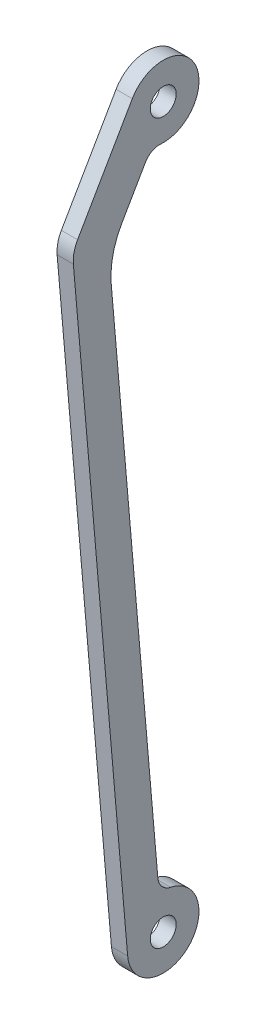
ISO-10303-21;
HEADER;
FILE_DESCRIPTION(('STEP AP214'),'2;1');
FILE_NAME('part.step','',(''),(''),'','','');
FILE_SCHEMA(('AUTOMOTIVE_DESIGN { 1 0 10303 214 1 1 1 1 }'));
ENDSEC;
DATA;
#1=APPLICATION_CONTEXT('core data for automotive mechanical design processes');
#2=APPLICATION_PROTOCOL_DEFINITION('international standard','automotive_design',2000,#1);
#3=PRODUCT_CONTEXT('',#1,'mechanical');
#4=PRODUCT('Part','Part','',(#3));
#5=PRODUCT_RELATED_PRODUCT_CATEGORY('part','',(#4));
#6=PRODUCT_DEFINITION_FORMATION('','',#4);
#7=PRODUCT_DEFINITION_CONTEXT('part definition',#1,'design');
#8=PRODUCT_DEFINITION('design','',#6,#7);
#9=PRODUCT_DEFINITION_SHAPE('','',#8);
#10=(LENGTH_UNIT() NAMED_UNIT(*) SI_UNIT(.MILLI.,.METRE.));
#11=(NAMED_UNIT(*) PLANE_ANGLE_UNIT() SI_UNIT($,.RADIAN.));
#12=(NAMED_UNIT(*) SI_UNIT($,.STERADIAN.) SOLID_ANGLE_UNIT());
#13=UNCERTAINTY_MEASURE_WITH_UNIT(LENGTH_MEASURE(1.E-05),#10,'distance_accuracy_value','');
#14=(GEOMETRIC_REPRESENTATION_CONTEXT(3) GLOBAL_UNCERTAINTY_ASSIGNED_CONTEXT((#13)) GLOBAL_UNIT_ASSIGNED_CONTEXT((#10,
#11,#12)) REPRESENTATION_CONTEXT('',''));
#15=CARTESIAN_POINT('',(0.,0.,0.));
#16=DIRECTION('',(0.,0.,1.));
#17=DIRECTION('',(1.,0.,0.));
#18=AXIS2_PLACEMENT_3D('',#15,#16,#17);
#19=CARTESIAN_POINT('',(113.199999999921,97.2400642056118,1.13156945828929));
#20=DIRECTION('',(1.,8.34917204817209E-13,0.));
#21=DIRECTION('',(0.,0.,1.));
#22=AXIS2_PLACEMENT_3D('',#19,#20,#21);
#23=PLANE('',#22);
#24=CARTESIAN_POINT('',(113.199999999908,113.200000000002,0.));
#25=DIRECTION('',(1.,8.34917204817209E-13,0.));
#26=DIRECTION('',(0.,0.,1.));
#27=AXIS2_PLACEMENT_3D('',#24,#25,#26);
#28=CIRCLE('',#27,4.);
#29=CARTESIAN_POINT('',(113.199999999908,113.200000000002,4.));
#30=VERTEX_POINT('',#29);
#31=EDGE_CURVE('E161',#30,#30,#28,.T.);
#32=ORIENTED_EDGE('',*,*,#31,.F.);
#33=EDGE_LOOP('',(#32));
#34=FACE_BOUND('',#33,.T.);
#35=CARTESIAN_POINT('',(113.199999999921,97.2400642056118,1.13156945828929));
#36=DIRECTION('',(-1.,-8.34917204817209E-13,0.));
#37=DIRECTION('',(0.,0.,1.));
#38=AXIS2_PLACEMENT_3D('',#35,#36,#37);
#39=CIRCLE('',#38,4.99999999999925);
#40=CARTESIAN_POINT('',(113.199999999919,99.74006420556,5.46169647723965));
#41=VERTEX_POINT('',#40);
#42=CARTESIAN_POINT('',(113.199999999917,102.227544141359,0.777954002572745));
#43=VERTEX_POINT('',#42);
#44=EDGE_CURVE('E185',#41,#43,#39,.T.);
#45=ORIENTED_EDGE('',*,*,#44,.T.);
#46=CARTESIAN_POINT('',(113.199999999908,113.200000000002,0.));
#47=DIRECTION('',(1.,8.34917204817209E-13,0.));
#48=DIRECTION('',(0.,0.,1.));
#49=AXIS2_PLACEMENT_3D('',#46,#47,#48);
#50=CIRCLE('',#49,11.);
#51=CARTESIAN_POINT('',(113.199999999903,118.699999999889,9.52627944169444));
#52=VERTEX_POINT('',#51);
#53=EDGE_CURVE('E109',#43,#52,#50,.T.);
#54=ORIENTED_EDGE('',*,*,#53,.T.);
#55=DIRECTION('',(7.23059509433379E-13,-0.866025403790403,0.499999999989669));
#56=VECTOR('',#55,1.);
#57=CARTESIAN_POINT('',(113.199999999903,118.699999999889,9.52627944169444));
#58=LINE('',#57,#56);
#59=CARTESIAN_POINT('',(113.199999999927,89.5267450916395,26.3694660156456));
#60=VERTEX_POINT('',#59);
#61=EDGE_CURVE('E214',#52,#60,#58,.T.);
#62=ORIENTED_EDGE('',*,*,#61,.T.);
#63=CARTESIAN_POINT('',(113.199999999932,84.5267450917569,17.709211977732));
#64=DIRECTION('',(1.,8.34917204817209E-13,0.));
#65=DIRECTION('',(0.,0.,1.));
#66=AXIS2_PLACEMENT_3D('',#63,#64,#65);
#67=CIRCLE('',#66,10.0000000000012);
#68=CARTESIAN_POINT('',(113.199999999932,83.6631878900357,27.6718556509435));
#69=VERTEX_POINT('',#68);
#70=EDGE_CURVE('E234',#60,#69,#67,.T.);
#71=ORIENTED_EDGE('',*,*,#70,.T.);
#72=DIRECTION('',(8.31798260822555E-13,-0.996264367320904,-0.0863557201734733));
#73=VECTOR('',#72,1.);
#74=CARTESIAN_POINT('',(113.199999999932,83.6631878900357,27.6718556509435));
#75=LINE('',#74,#73);
#76=CARTESIAN_POINT('',(113.200000000093,-109.149912921906,10.9589080381815));
#77=VERTEX_POINT('',#76);
#78=EDGE_CURVE('E230',#69,#77,#75,.T.);
#79=ORIENTED_EDGE('',*,*,#78,.T.);
#80=CARTESIAN_POINT('',(113.200000000093,-108.199999999998,-2.34845256395263E-09));
#81=DIRECTION('',(1.,8.34917204817209E-13,0.));
#82=DIRECTION('',(0.,0.,1.));
#83=AXIS2_PLACEMENT_3D('',#80,#81,#82);
#84=CIRCLE('',#83,11.);
#85=CARTESIAN_POINT('',(113.200000000084,-97.4387806499971,-2.27950830484906));
#86=VERTEX_POINT('',#85);
#87=EDGE_CURVE('E233',#77,#86,#84,.T.);
#88=ORIENTED_EDGE('',*,*,#87,.T.);
#89=CARTESIAN_POINT('',(113.200000000079,-92.5473173090877,-3.31564844234932));
#90=DIRECTION('',(-1.,-8.34917204817209E-13,0.));
#91=DIRECTION('',(0.,0.,1.));
#92=AXIS2_PLACEMENT_3D('',#89,#90,#91);
#93=CIRCLE('',#92,5.);
#94=CARTESIAN_POINT('',(113.20000000008,-92.979095909955,1.6656733942552));
#95=VERTEX_POINT('',#94);
#96=EDGE_CURVE('E134',#86,#95,#93,.T.);
#97=ORIENTED_EDGE('',*,*,#96,.T.);
#98=DIRECTION('',(-8.31798260822554E-13,0.996264367320904,0.0863557201734732));
#99=VECTOR('',#98,1.);
#100=CARTESIAN_POINT('',(113.199999999942,72.4579697256369,16.0056793354151));
#101=LINE('',#100,#99);
#102=CARTESIAN_POINT('',(113.199999999942,72.4579697256369,16.0056793354151));
#103=VERTEX_POINT('',#102);
#104=EDGE_CURVE('E128',#95,#103,#101,.T.);
#105=ORIENTED_EDGE('',*,*,#104,.T.);
#106=CARTESIAN_POINT('',(113.19999999994,74.6168627299737,-8.90092984760749));
#107=DIRECTION('',(-1.,-8.34917204817209E-13,0.));
#108=DIRECTION('',(0.,0.,1.));
#109=AXIS2_PLACEMENT_3D('',#106,#107,#108);
#110=CIRCLE('',#109,25.);
#111=CARTESIAN_POINT('',(113.199999999929,87.1168627297154,12.7497052471526));
#112=VERTEX_POINT('',#111);
#113=EDGE_CURVE('E132',#103,#112,#110,.T.);
#114=ORIENTED_EDGE('',*,*,#113,.T.);
#115=DIRECTION('',(-7.23059509433379E-13,0.866025403790404,-0.499999999989669));
#116=VECTOR('',#115,1.);
#117=CARTESIAN_POINT('',(113.199999999929,87.1168627297154,12.7497052471526));
#118=LINE('',#117,#116);
#119=EDGE_CURVE('E60',#112,#41,#118,.T.);
#120=ORIENTED_EDGE('',*,*,#119,.T.);
#121=EDGE_LOOP('',(#45,#54,#62,#71,#79,#88,#97,#105,#114,#120));
#122=FACE_BOUND('',#121,.T.);
#123=CARTESIAN_POINT('',(113.200000000093,-108.199999999998,-2.34845256395263E-09));
#124=DIRECTION('',(1.,8.34917204817209E-13,0.));
#125=DIRECTION('',(0.,0.,1.));
#126=AXIS2_PLACEMENT_3D('',#123,#124,#125);
#127=CIRCLE('',#126,3.99999999931337);
#128=CARTESIAN_POINT('',(113.200000000093,-108.199999999998,3.99999999696492));
#129=VERTEX_POINT('',#128);
#130=EDGE_CURVE('E252',#129,#129,#127,.T.);
#131=ORIENTED_EDGE('',*,*,#130,.F.);
#132=EDGE_LOOP('',(#131));
#133=FACE_BOUND('',#132,.T.);
#134=ADVANCED_FACE('F42',(#34,#122,#133),#23,.T.);
#135=CARTESIAN_POINT('',(108.199999999921,97.2400642056076,1.13156945828929));
#136=DIRECTION('',(1.,8.34917204817209E-13,0.));
#137=DIRECTION('',(0.,0.,1.));
#138=AXIS2_PLACEMENT_3D('',#135,#136,#137);
#139=PLANE('',#138);
#140=CARTESIAN_POINT('',(108.199999999921,97.2400642056076,1.13156945828929));
#141=DIRECTION('',(-1.,-8.34917204817209E-13,0.));
#142=DIRECTION('',(0.,0.,1.));
#143=AXIS2_PLACEMENT_3D('',#140,#141,#142);
#144=CIRCLE('',#143,4.99999999999925);
#145=CARTESIAN_POINT('',(108.199999999919,99.7400642055558,5.46169647723965));
#146=VERTEX_POINT('',#145);
#147=CARTESIAN_POINT('',(108.199999999917,102.227544141355,0.777954002572745));
#148=VERTEX_POINT('',#147);
#149=EDGE_CURVE('E156',#146,#148,#144,.T.);
#150=ORIENTED_EDGE('',*,*,#149,.F.);
#151=DIRECTION('',(-7.23059509433379E-13,0.866025403790404,-0.499999999989669));
#152=VECTOR('',#151,1.);
#153=CARTESIAN_POINT('',(108.199999999929,87.1168627297112,12.7497052471526));
#154=LINE('',#153,#152);
#155=CARTESIAN_POINT('',(108.199999999929,87.1168627297112,12.7497052471526));
#156=VERTEX_POINT('',#155);
#157=EDGE_CURVE('E101',#156,#146,#154,.T.);
#158=ORIENTED_EDGE('',*,*,#157,.F.);
#159=CARTESIAN_POINT('',(108.19999999994,74.6168627299695,-8.90092984760749));
#160=DIRECTION('',(-1.,-8.34917204817209E-13,0.));
#161=DIRECTION('',(0.,0.,1.));
#162=AXIS2_PLACEMENT_3D('',#159,#160,#161);
#163=CIRCLE('',#162,25.);
#164=CARTESIAN_POINT('',(108.199999999942,72.4579697256327,16.0056793354151));
#165=VERTEX_POINT('',#164);
#166=EDGE_CURVE('E95',#165,#156,#163,.T.);
#167=ORIENTED_EDGE('',*,*,#166,.F.);
#168=DIRECTION('',(-8.31798260822554E-13,0.996264367320904,0.0863557201734732));
#169=VECTOR('',#168,1.);
#170=CARTESIAN_POINT('',(108.199999999942,72.4579697256327,16.0056793354151));
#171=LINE('',#170,#169);
#172=CARTESIAN_POINT('',(108.20000000008,-92.9790959099592,1.6656733942552));
#173=VERTEX_POINT('',#172);
#174=EDGE_CURVE('E143',#173,#165,#171,.T.);
#175=ORIENTED_EDGE('',*,*,#174,.F.);
#176=CARTESIAN_POINT('',(108.200000000079,-92.5473173090918,-3.31564844234932));
#177=DIRECTION('',(-1.,-8.34917204817209E-13,0.));
#178=DIRECTION('',(0.,0.,1.));
#179=AXIS2_PLACEMENT_3D('',#176,#177,#178);
#180=CIRCLE('',#179,5.);
#181=CARTESIAN_POINT('',(108.200000000084,-97.4387806500012,-2.27950830484906));
#182=VERTEX_POINT('',#181);
#183=EDGE_CURVE('E176',#182,#173,#180,.T.);
#184=ORIENTED_EDGE('',*,*,#183,.F.);
#185=CARTESIAN_POINT('',(108.200000000093,-108.200000000002,-2.34845256395263E-09));
#186=DIRECTION('',(1.,8.34917204817209E-13,0.));
#187=DIRECTION('',(0.,0.,1.));
#188=AXIS2_PLACEMENT_3D('',#185,#186,#187);
#189=CIRCLE('',#188,11.);
#190=CARTESIAN_POINT('',(108.200000000093,-109.14991292191,10.9589080381815));
#191=VERTEX_POINT('',#190);
#192=EDGE_CURVE('E173',#191,#182,#189,.T.);
#193=ORIENTED_EDGE('',*,*,#192,.F.);
#194=DIRECTION('',(8.31798260822555E-13,-0.996264367320904,-0.0863557201734733));
#195=VECTOR('',#194,1.);
#196=CARTESIAN_POINT('',(108.199999999932,83.6631878900315,27.6718556509435));
#197=LINE('',#196,#195);
#198=CARTESIAN_POINT('',(108.199999999932,83.6631878900315,27.6718556509435));
#199=VERTEX_POINT('',#198);
#200=EDGE_CURVE('E170',#199,#191,#197,.T.);
#201=ORIENTED_EDGE('',*,*,#200,.F.);
#202=CARTESIAN_POINT('',(108.199999999932,84.5267450917527,17.709211977732));
#203=DIRECTION('',(1.,8.34917204817209E-13,0.));
#204=DIRECTION('',(0.,0.,1.));
#205=AXIS2_PLACEMENT_3D('',#202,#203,#204);
#206=CIRCLE('',#205,10.0000000000012);
#207=CARTESIAN_POINT('',(108.199999999927,89.5267450916353,26.3694660156456));
#208=VERTEX_POINT('',#207);
#209=EDGE_CURVE('E167',#208,#199,#206,.T.);
#210=ORIENTED_EDGE('',*,*,#209,.F.);
#211=DIRECTION('',(7.23059509433379E-13,-0.866025403790403,0.499999999989669));
#212=VECTOR('',#211,1.);
#213=CARTESIAN_POINT('',(108.199999999903,118.699999999884,9.52627944169444));
#214=LINE('',#213,#212);
#215=CARTESIAN_POINT('',(108.199999999903,118.699999999884,9.52627944169444));
#216=VERTEX_POINT('',#215);
#217=EDGE_CURVE('E164',#216,#208,#214,.T.);
#218=ORIENTED_EDGE('',*,*,#217,.F.);
#219=CARTESIAN_POINT('',(108.199999999908,113.199999999998,0.));
#220=DIRECTION('',(1.,8.34917204817209E-13,0.));
#221=DIRECTION('',(0.,0.,1.));
#222=AXIS2_PLACEMENT_3D('',#219,#220,#221);
#223=CIRCLE('',#222,11.);
#224=EDGE_CURVE('E160',#148,#216,#223,.T.);
#225=ORIENTED_EDGE('',*,*,#224,.F.);
#226=EDGE_LOOP('',(#150,#158,#167,#175,#184,#193,#201,#210,#218,#225));
#227=FACE_BOUND('',#226,.T.);
#228=CARTESIAN_POINT('',(108.199999999908,113.199999999998,0.));
#229=DIRECTION('',(1.,8.34917204817209E-13,0.));
#230=DIRECTION('',(0.,0.,1.));
#231=AXIS2_PLACEMENT_3D('',#228,#229,#230);
#232=CIRCLE('',#231,4.);
#233=CARTESIAN_POINT('',(108.199999999908,113.199999999998,4.));
#234=VERTEX_POINT('',#233);
#235=EDGE_CURVE('E248',#234,#234,#232,.T.);
#236=ORIENTED_EDGE('',*,*,#235,.T.);
#237=EDGE_LOOP('',(#236));
#238=FACE_BOUND('',#237,.T.);
#239=CARTESIAN_POINT('',(108.200000000093,-108.200000000002,-2.34845256395263E-09));
#240=DIRECTION('',(1.,8.34917204817209E-13,0.));
#241=DIRECTION('',(0.,0.,1.));
#242=AXIS2_PLACEMENT_3D('',#239,#240,#241);
#243=CIRCLE('',#242,3.99999999931337);
#244=CARTESIAN_POINT('',(108.200000000093,-108.200000000002,3.99999999696492));
#245=VERTEX_POINT('',#244);
#246=EDGE_CURVE('E256',#245,#245,#243,.T.);
#247=ORIENTED_EDGE('',*,*,#246,.T.);
#248=EDGE_LOOP('',(#247));
#249=FACE_BOUND('',#248,.T.);
#250=ADVANCED_FACE('F218',(#227,#238,#249),#139,.F.);
#251=CARTESIAN_POINT('',(113.199999999921,97.2400642056118,1.13156945828929));
#252=DIRECTION('',(-1.,-8.34917204817209E-13,0.));
#253=DIRECTION('',(0.,0.,-1.));
#254=AXIS2_PLACEMENT_3D('',#251,#252,#253);
#255=CYLINDRICAL_SURFACE('',#254,4.99999999999925);
#256=ORIENTED_EDGE('',*,*,#149,.T.);
#257=DIRECTION('',(-1.,-8.34917204817209E-13,0.));
#258=VECTOR('',#257,1.);
#259=CARTESIAN_POINT('',(113.199999999917,102.227544141359,0.777954002572745));
#260=LINE('',#259,#258);
#261=EDGE_CURVE('E11',#43,#148,#260,.T.);
#262=ORIENTED_EDGE('',*,*,#261,.F.);
#263=ORIENTED_EDGE('',*,*,#44,.F.);
#264=DIRECTION('',(-1.,-8.34917204817209E-13,0.));
#265=VECTOR('',#264,1.);
#266=CARTESIAN_POINT('',(113.199999999919,99.74006420556,5.46169647723965));
#267=LINE('',#266,#265);
#268=EDGE_CURVE('E152',#41,#146,#267,.T.);
#269=ORIENTED_EDGE('',*,*,#268,.T.);
#270=EDGE_LOOP('',(#256,#262,#263,#269));
#271=FACE_BOUND('',#270,.T.);
#272=ADVANCED_FACE('F44',(#271),#255,.F.);
#273=CARTESIAN_POINT('',(113.199999999908,113.200000000002,0.));
#274=DIRECTION('',(-1.,-8.34917204817209E-13,0.));
#275=DIRECTION('',(0.,0.,-1.));
#276=AXIS2_PLACEMENT_3D('',#273,#274,#275);
#277=CYLINDRICAL_SURFACE('',#276,11.);
#278=ORIENTED_EDGE('',*,*,#224,.T.);
#279=DIRECTION('',(-1.,-8.34917204817209E-13,0.));
#280=VECTOR('',#279,1.);
#281=CARTESIAN_POINT('',(113.199999999903,118.699999999889,9.52627944169444));
#282=LINE('',#281,#280);
#283=EDGE_CURVE('E52',#52,#216,#282,.T.);
#284=ORIENTED_EDGE('',*,*,#283,.F.);
#285=ORIENTED_EDGE('',*,*,#53,.F.);
#286=ORIENTED_EDGE('',*,*,#261,.T.);
#287=EDGE_LOOP('',(#278,#284,#285,#286));
#288=FACE_BOUND('',#287,.T.);
#289=ADVANCED_FACE('F298',(#288),#277,.T.);
#290=CARTESIAN_POINT('',(113.199999999903,118.699999999889,9.52627944169444));
#291=DIRECTION('',(4.17458602399979E-13,-0.499999999989669,-0.866025403790403));
#292=DIRECTION('',(-7.23059509433379E-13,0.866025403790404,-0.499999999989669));
#293=AXIS2_PLACEMENT_3D('',#290,#291,#292);
#294=PLANE('',#293);
#295=ORIENTED_EDGE('',*,*,#217,.T.);
#296=DIRECTION('',(-1.,-8.34917204817209E-13,0.));
#297=VECTOR('',#296,1.);
#298=CARTESIAN_POINT('',(113.199999999927,89.5267450916395,26.3694660156456));
#299=LINE('',#298,#297);
#300=EDGE_CURVE('E204',#60,#208,#299,.T.);
#301=ORIENTED_EDGE('',*,*,#300,.F.);
#302=ORIENTED_EDGE('',*,*,#61,.F.);
#303=ORIENTED_EDGE('',*,*,#283,.T.);
#304=EDGE_LOOP('',(#295,#301,#302,#303));
#305=FACE_BOUND('',#304,.T.);
#306=ADVANCED_FACE('F212',(#305),#294,.F.);
#307=CARTESIAN_POINT('',(113.199999999932,84.5267450917569,17.709211977732));
#308=DIRECTION('',(-1.,-8.34917204817209E-13,0.));
#309=DIRECTION('',(0.,0.,-1.));
#310=AXIS2_PLACEMENT_3D('',#307,#308,#309);
#311=CYLINDRICAL_SURFACE('',#310,10.0000000000012);
#312=ORIENTED_EDGE('',*,*,#209,.T.);
#313=DIRECTION('',(-1.,-8.34917204817209E-13,0.));
#314=VECTOR('',#313,1.);
#315=CARTESIAN_POINT('',(113.199999999932,83.6631878900357,27.6718556509435));
#316=LINE('',#315,#314);
#317=EDGE_CURVE('E200',#69,#199,#316,.T.);
#318=ORIENTED_EDGE('',*,*,#317,.F.);
#319=ORIENTED_EDGE('',*,*,#70,.F.);
#320=ORIENTED_EDGE('',*,*,#300,.T.);
#321=EDGE_LOOP('',(#312,#318,#319,#320));
#322=FACE_BOUND('',#321,.T.);
#323=ADVANCED_FACE('F224',(#322),#311,.T.);
#324=CARTESIAN_POINT('',(113.199999999932,83.6631878900357,27.6718556509435));
#325=DIRECTION('',(0.,0.0863557201734733,-0.996264367320904));
#326=DIRECTION('',(-8.31798260822555E-13,0.996264367320904,0.0863557201734733));
#327=AXIS2_PLACEMENT_3D('',#324,#325,#326);
#328=PLANE('',#327);
#329=ORIENTED_EDGE('',*,*,#200,.T.);
#330=DIRECTION('',(-1.,-8.34917204817209E-13,0.));
#331=VECTOR('',#330,1.);
#332=CARTESIAN_POINT('',(113.200000000093,-109.149912921906,10.9589080381815));
#333=LINE('',#332,#331);
#334=EDGE_CURVE('E196',#77,#191,#333,.T.);
#335=ORIENTED_EDGE('',*,*,#334,.F.);
#336=ORIENTED_EDGE('',*,*,#78,.F.);
#337=ORIENTED_EDGE('',*,*,#317,.T.);
#338=EDGE_LOOP('',(#329,#335,#336,#337));
#339=FACE_BOUND('',#338,.T.);
#340=ADVANCED_FACE('F228',(#339),#328,.F.);
#341=CARTESIAN_POINT('',(113.200000000093,-108.199999999998,-2.34845256395263E-09));
#342=DIRECTION('',(-1.,-8.34917204817209E-13,0.));
#343=DIRECTION('',(0.,0.,-1.));
#344=AXIS2_PLACEMENT_3D('',#341,#342,#343);
#345=CYLINDRICAL_SURFACE('',#344,11.);
#346=ORIENTED_EDGE('',*,*,#192,.T.);
#347=DIRECTION('',(-1.,-8.34917204817209E-13,0.));
#348=VECTOR('',#347,1.);
#349=CARTESIAN_POINT('',(113.200000000084,-97.4387806499971,-2.27950830484906));
#350=LINE('',#349,#348);
#351=EDGE_CURVE('E192',#86,#182,#350,.T.);
#352=ORIENTED_EDGE('',*,*,#351,.F.);
#353=ORIENTED_EDGE('',*,*,#87,.F.);
#354=ORIENTED_EDGE('',*,*,#334,.T.);
#355=EDGE_LOOP('',(#346,#352,#353,#354));
#356=FACE_BOUND('',#355,.T.);
#357=ADVANCED_FACE('F288',(#356),#345,.T.);
#358=CARTESIAN_POINT('',(113.200000000079,-92.5473173090877,-3.31564844234932));
#359=DIRECTION('',(-1.,-8.34917204817209E-13,0.));
#360=DIRECTION('',(0.,0.,-1.));
#361=AXIS2_PLACEMENT_3D('',#358,#359,#360);
#362=CYLINDRICAL_SURFACE('',#361,5.);
#363=ORIENTED_EDGE('',*,*,#183,.T.);
#364=DIRECTION('',(-1.,-8.34917204817209E-13,0.));
#365=VECTOR('',#364,1.);
#366=CARTESIAN_POINT('',(113.20000000008,-92.979095909955,1.6656733942552));
#367=LINE('',#366,#365);
#368=EDGE_CURVE('E145',#95,#173,#367,.T.);
#369=ORIENTED_EDGE('',*,*,#368,.F.);
#370=ORIENTED_EDGE('',*,*,#96,.F.);
#371=ORIENTED_EDGE('',*,*,#351,.T.);
#372=EDGE_LOOP('',(#363,#369,#370,#371));
#373=FACE_BOUND('',#372,.T.);
#374=ADVANCED_FACE('F285',(#373),#362,.F.);
#375=CARTESIAN_POINT('',(113.199999999942,72.4579697256369,16.0056793354151));
#376=DIRECTION('',(0.,-0.0863557201734732,0.996264367320904));
#377=DIRECTION('',(8.31798260822555E-13,-0.996264367320904,-0.0863557201734732));
#378=AXIS2_PLACEMENT_3D('',#375,#376,#377);
#379=PLANE('',#378);
#380=ORIENTED_EDGE('',*,*,#174,.T.);
#381=DIRECTION('',(-1.,-8.34917204817209E-13,0.));
#382=VECTOR('',#381,1.);
#383=CARTESIAN_POINT('',(113.199999999942,72.4579697256369,16.0056793354151));
#384=LINE('',#383,#382);
#385=EDGE_CURVE('E140',#103,#165,#384,.T.);
#386=ORIENTED_EDGE('',*,*,#385,.F.);
#387=ORIENTED_EDGE('',*,*,#104,.F.);
#388=ORIENTED_EDGE('',*,*,#368,.T.);
#389=EDGE_LOOP('',(#380,#386,#387,#388));
#390=FACE_BOUND('',#389,.T.);
#391=ADVANCED_FACE('F141',(#390),#379,.F.);
#392=CARTESIAN_POINT('',(113.19999999994,74.6168627299737,-8.90092984760749));
#393=DIRECTION('',(-1.,-8.34917204817209E-13,0.));
#394=DIRECTION('',(0.,0.,-1.));
#395=AXIS2_PLACEMENT_3D('',#392,#393,#394);
#396=CYLINDRICAL_SURFACE('',#395,25.);
#397=ORIENTED_EDGE('',*,*,#166,.T.);
#398=DIRECTION('',(-1.,-8.34917204817209E-13,0.));
#399=VECTOR('',#398,1.);
#400=CARTESIAN_POINT('',(113.199999999929,87.1168627297154,12.7497052471526));
#401=LINE('',#400,#399);
#402=EDGE_CURVE('E146',#112,#156,#401,.T.);
#403=ORIENTED_EDGE('',*,*,#402,.F.);
#404=ORIENTED_EDGE('',*,*,#113,.F.);
#405=ORIENTED_EDGE('',*,*,#385,.T.);
#406=EDGE_LOOP('',(#397,#403,#404,#405));
#407=FACE_BOUND('',#406,.T.);
#408=ADVANCED_FACE('F148',(#407),#396,.F.);
#409=CARTESIAN_POINT('',(113.199999999929,87.1168627297154,12.7497052471526));
#410=DIRECTION('',(-4.17458602399979E-13,0.499999999989669,0.866025403790403));
#411=DIRECTION('',(7.23059509433379E-13,-0.866025403790404,0.499999999989669));
#412=AXIS2_PLACEMENT_3D('',#409,#410,#411);
#413=PLANE('',#412);
#414=ORIENTED_EDGE('',*,*,#157,.T.);
#415=ORIENTED_EDGE('',*,*,#268,.F.);
#416=ORIENTED_EDGE('',*,*,#119,.F.);
#417=ORIENTED_EDGE('',*,*,#402,.T.);
#418=EDGE_LOOP('',(#414,#415,#416,#417));
#419=FACE_BOUND('',#418,.T.);
#420=ADVANCED_FACE('F278',(#419),#413,.F.);
#421=CARTESIAN_POINT('',(113.199999999908,113.200000000002,0.));
#422=DIRECTION('',(-1.,-8.34917204817209E-13,0.));
#423=DIRECTION('',(0.,0.,-1.));
#424=AXIS2_PLACEMENT_3D('',#421,#422,#423);
#425=CYLINDRICAL_SURFACE('',#424,4.);
#426=ORIENTED_EDGE('',*,*,#31,.T.);
#427=EDGE_LOOP('',(#426));
#428=FACE_BOUND('',#427,.T.);
#429=ORIENTED_EDGE('',*,*,#235,.F.);
#430=EDGE_LOOP('',(#429));
#431=FACE_BOUND('',#430,.T.);
#432=ADVANCED_FACE('F275',(#428,#431),#425,.F.);
#433=CARTESIAN_POINT('',(113.200000000093,-108.199999999998,-2.34845256395263E-09));
#434=DIRECTION('',(-1.,-8.34917204817209E-13,0.));
#435=DIRECTION('',(0.,0.,-1.));
#436=AXIS2_PLACEMENT_3D('',#433,#434,#435);
#437=CYLINDRICAL_SURFACE('',#436,3.99999999931337);
#438=ORIENTED_EDGE('',*,*,#130,.T.);
#439=EDGE_LOOP('',(#438));
#440=FACE_BOUND('',#439,.T.);
#441=ORIENTED_EDGE('',*,*,#246,.F.);
#442=EDGE_LOOP('',(#441));
#443=FACE_BOUND('',#442,.T.);
#444=ADVANCED_FACE('F264',(#440,#443),#437,.F.);
#445=CLOSED_SHELL('',(#134,#250,#272,#289,#306,#323,#340,#357,#374,#391,#408,#420,#432,#444));
#446=MANIFOLD_SOLID_BREP('B2',#445);
#447=ADVANCED_BREP_SHAPE_REPRESENTATION('',(#18,#446),#14);
#448=SHAPE_DEFINITION_REPRESENTATION(#9,#447);
ENDSEC;
END-ISO-10303-21;
